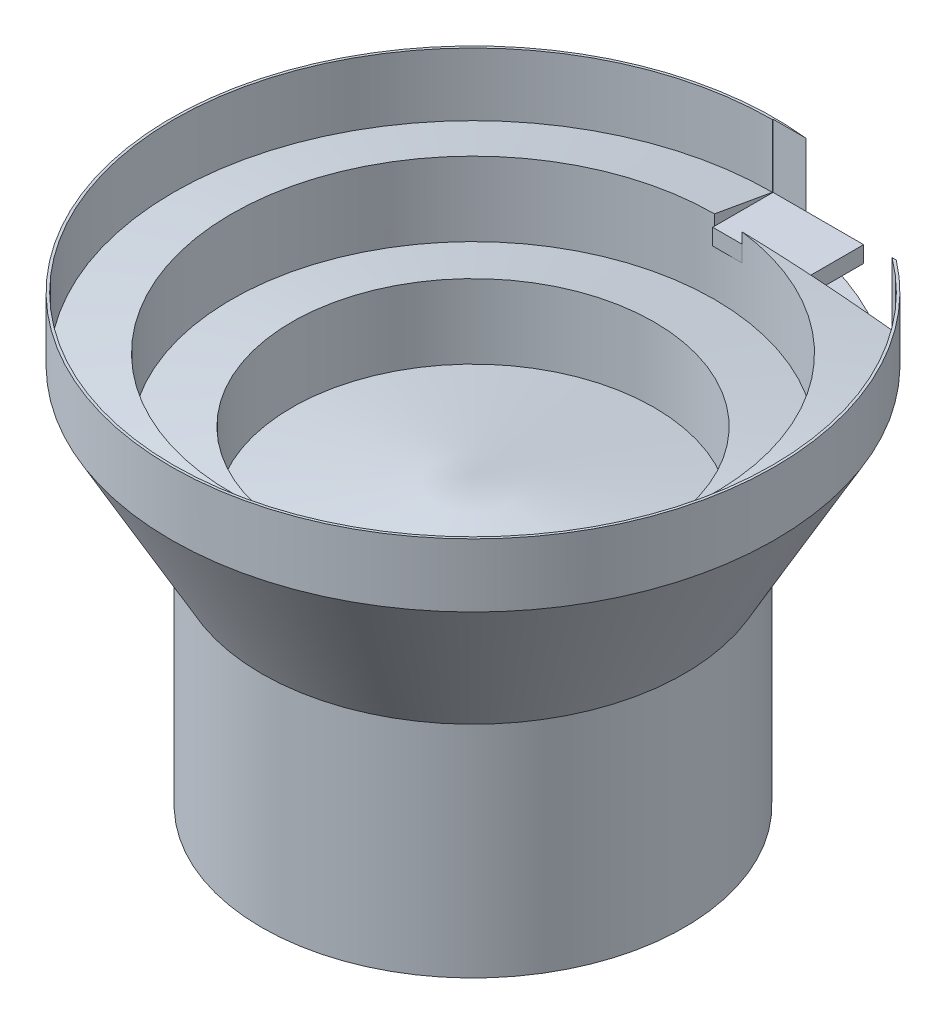
ISO-10303-21;
HEADER;
FILE_DESCRIPTION(('STEP AP214'),'2;1');
FILE_NAME('part.step','',(''),(''),'','','');
FILE_SCHEMA(('AUTOMOTIVE_DESIGN { 1 0 10303 214 1 1 1 1 }'));
ENDSEC;
DATA;
#1=APPLICATION_CONTEXT('core data for automotive mechanical design processes');
#2=APPLICATION_PROTOCOL_DEFINITION('international standard','automotive_design',2000,#1);
#3=PRODUCT_CONTEXT('',#1,'mechanical');
#4=PRODUCT('Part','Part','',(#3));
#5=PRODUCT_RELATED_PRODUCT_CATEGORY('part','',(#4));
#6=PRODUCT_DEFINITION_FORMATION('','',#4);
#7=PRODUCT_DEFINITION_CONTEXT('part definition',#1,'design');
#8=PRODUCT_DEFINITION('design','',#6,#7);
#9=PRODUCT_DEFINITION_SHAPE('','',#8);
#10=(LENGTH_UNIT() NAMED_UNIT(*) SI_UNIT(.MILLI.,.METRE.));
#11=(NAMED_UNIT(*) PLANE_ANGLE_UNIT() SI_UNIT($,.RADIAN.));
#12=(NAMED_UNIT(*) SI_UNIT($,.STERADIAN.) SOLID_ANGLE_UNIT());
#13=UNCERTAINTY_MEASURE_WITH_UNIT(LENGTH_MEASURE(1.E-05),#10,'distance_accuracy_value','');
#14=(GEOMETRIC_REPRESENTATION_CONTEXT(3) GLOBAL_UNCERTAINTY_ASSIGNED_CONTEXT((#13)) GLOBAL_UNIT_ASSIGNED_CONTEXT((#10,
#11,#12)) REPRESENTATION_CONTEXT('',''));
#15=CARTESIAN_POINT('',(0.,0.,0.));
#16=DIRECTION('',(0.,0.,1.));
#17=DIRECTION('',(1.,0.,0.));
#18=AXIS2_PLACEMENT_3D('',#15,#16,#17);
#19=CARTESIAN_POINT('',(0.,631.,-397.));
#20=DIRECTION('',(1.,0.,0.));
#21=DIRECTION('',(0.,0.,-1.));
#22=AXIS2_PLACEMENT_3D('',#19,#20,#21);
#23=PLANE('',#22);
#24=DIRECTION('',(0.,0.,1.));
#25=VECTOR('',#24,1.);
#26=CARTESIAN_POINT('',(0.,604.,-397.));
#27=LINE('',#26,#25);
#28=CARTESIAN_POINT('',(0.,604.,-497.));
#29=VERTEX_POINT('',#28);
#30=CARTESIAN_POINT('',(0.,604.,-397.));
#31=VERTEX_POINT('',#30);
#32=EDGE_CURVE('E112',#29,#31,#27,.T.);
#33=ORIENTED_EDGE('',*,*,#32,.T.);
#34=DIRECTION('',(0.,-1.,0.));
#35=VECTOR('',#34,1.);
#36=CARTESIAN_POINT('',(0.,631.,-397.));
#37=LINE('',#36,#35);
#38=CARTESIAN_POINT('',(0.,631.,-397.));
#39=VERTEX_POINT('',#38);
#40=EDGE_CURVE('E12',#39,#31,#37,.T.);
#41=ORIENTED_EDGE('',*,*,#40,.F.);
#42=DIRECTION('',(0.,0.,1.));
#43=VECTOR('',#42,1.);
#44=CARTESIAN_POINT('',(0.,631.,-397.));
#45=LINE('',#44,#43);
#46=CARTESIAN_POINT('',(0.,631.,-497.));
#47=VERTEX_POINT('',#46);
#48=EDGE_CURVE('E100',#47,#39,#45,.T.);
#49=ORIENTED_EDGE('',*,*,#48,.F.);
#50=DIRECTION('',(0.,-1.,0.));
#51=VECTOR('',#50,1.);
#52=CARTESIAN_POINT('',(0.,631.,-497.));
#53=LINE('',#52,#51);
#54=EDGE_CURVE('E108',#47,#29,#53,.T.);
#55=ORIENTED_EDGE('',*,*,#54,.T.);
#56=EDGE_LOOP('',(#33,#41,#49,#55));
#57=FACE_BOUND('',#56,.T.);
#58=ADVANCED_FACE('F49',(#57),#23,.F.);
#59=CARTESIAN_POINT('',(150.,631.,-397.));
#60=DIRECTION('',(0.,0.,-1.));
#61=DIRECTION('',(-1.,0.,0.));
#62=AXIS2_PLACEMENT_3D('',#59,#60,#61);
#63=PLANE('',#62);
#64=DIRECTION('',(1.,0.,0.));
#65=VECTOR('',#64,1.);
#66=CARTESIAN_POINT('',(150.,604.,-397.));
#67=LINE('',#66,#65);
#68=CARTESIAN_POINT('',(150.,604.,-397.));
#69=VERTEX_POINT('',#68);
#70=EDGE_CURVE('E104',#31,#69,#67,.T.);
#71=ORIENTED_EDGE('',*,*,#70,.T.);
#72=DIRECTION('',(0.,-1.,0.));
#73=VECTOR('',#72,1.);
#74=CARTESIAN_POINT('',(150.,631.,-397.));
#75=LINE('',#74,#73);
#76=CARTESIAN_POINT('',(150.,631.,-397.));
#77=VERTEX_POINT('',#76);
#78=EDGE_CURVE('E57',#77,#69,#75,.T.);
#79=ORIENTED_EDGE('',*,*,#78,.F.);
#80=DIRECTION('',(1.,0.,0.));
#81=VECTOR('',#80,1.);
#82=CARTESIAN_POINT('',(150.,631.,-397.));
#83=LINE('',#82,#81);
#84=EDGE_CURVE('E95',#39,#77,#83,.T.);
#85=ORIENTED_EDGE('',*,*,#84,.F.);
#86=ORIENTED_EDGE('',*,*,#40,.T.);
#87=EDGE_LOOP('',(#71,#79,#85,#86));
#88=FACE_BOUND('',#87,.T.);
#89=ADVANCED_FACE('F103',(#88),#63,.F.);
#90=CARTESIAN_POINT('',(150.,631.,-497.));
#91=DIRECTION('',(-1.,0.,0.));
#92=DIRECTION('',(0.,0.,1.));
#93=AXIS2_PLACEMENT_3D('',#90,#91,#92);
#94=PLANE('',#93);
#95=DIRECTION('',(0.,0.,-1.));
#96=VECTOR('',#95,1.);
#97=CARTESIAN_POINT('',(150.,604.,-497.));
#98=LINE('',#97,#96);
#99=CARTESIAN_POINT('',(150.,604.,-497.));
#100=VERTEX_POINT('',#99);
#101=EDGE_CURVE('E82',#69,#100,#98,.T.);
#102=ORIENTED_EDGE('',*,*,#101,.T.);
#103=DIRECTION('',(0.,-1.,0.));
#104=VECTOR('',#103,1.);
#105=CARTESIAN_POINT('',(150.,631.,-497.));
#106=LINE('',#105,#104);
#107=CARTESIAN_POINT('',(150.,631.,-497.));
#108=VERTEX_POINT('',#107);
#109=EDGE_CURVE('E105',#108,#100,#106,.T.);
#110=ORIENTED_EDGE('',*,*,#109,.F.);
#111=DIRECTION('',(0.,0.,-1.));
#112=VECTOR('',#111,1.);
#113=CARTESIAN_POINT('',(150.,631.,-497.));
#114=LINE('',#113,#112);
#115=EDGE_CURVE('E98',#77,#108,#114,.T.);
#116=ORIENTED_EDGE('',*,*,#115,.F.);
#117=ORIENTED_EDGE('',*,*,#78,.T.);
#118=EDGE_LOOP('',(#102,#110,#116,#117));
#119=FACE_BOUND('',#118,.T.);
#120=ADVANCED_FACE('F106',(#119),#94,.F.);
#121=CARTESIAN_POINT('',(0.,631.,-497.));
#122=DIRECTION('',(0.,0.,1.));
#123=DIRECTION('',(1.,0.,0.));
#124=AXIS2_PLACEMENT_3D('',#121,#122,#123);
#125=PLANE('',#124);
#126=DIRECTION('',(-1.,0.,0.));
#127=VECTOR('',#126,1.);
#128=CARTESIAN_POINT('',(0.,604.,-497.));
#129=LINE('',#128,#127);
#130=EDGE_CURVE('E88',#100,#29,#129,.T.);
#131=ORIENTED_EDGE('',*,*,#130,.T.);
#132=ORIENTED_EDGE('',*,*,#54,.F.);
#133=DIRECTION('',(-1.,0.,0.));
#134=VECTOR('',#133,1.);
#135=CARTESIAN_POINT('',(0.,631.,-497.));
#136=LINE('',#135,#134);
#137=EDGE_CURVE('E65',#108,#47,#136,.T.);
#138=ORIENTED_EDGE('',*,*,#137,.F.);
#139=ORIENTED_EDGE('',*,*,#109,.T.);
#140=EDGE_LOOP('',(#131,#132,#138,#139));
#141=FACE_BOUND('',#140,.T.);
#142=ADVANCED_FACE('F119',(#141),#125,.F.);
#143=CARTESIAN_POINT('',(0.,631.,0.));
#144=DIRECTION('',(0.,-1.,0.));
#145=DIRECTION('',(0.,0.,-1.));
#146=AXIS2_PLACEMENT_3D('',#143,#144,#145);
#147=PLANE('',#146);
#148=ORIENTED_EDGE('',*,*,#48,.T.);
#149=ORIENTED_EDGE('',*,*,#84,.T.);
#150=ORIENTED_EDGE('',*,*,#115,.T.);
#151=ORIENTED_EDGE('',*,*,#137,.T.);
#152=EDGE_LOOP('',(#148,#149,#150,#151));
#153=FACE_BOUND('',#152,.T.);
#154=ADVANCED_FACE('F96',(#153),#147,.F.);
#155=CARTESIAN_POINT('',(0.,604.,0.));
#156=DIRECTION('',(0.,-1.,0.));
#157=DIRECTION('',(0.,0.,-1.));
#158=AXIS2_PLACEMENT_3D('',#155,#156,#157);
#159=PLANE('',#158);
#160=ORIENTED_EDGE('',*,*,#32,.F.);
#161=ORIENTED_EDGE('',*,*,#130,.F.);
#162=ORIENTED_EDGE('',*,*,#101,.F.);
#163=ORIENTED_EDGE('',*,*,#70,.F.);
#164=EDGE_LOOP('',(#160,#161,#162,#163));
#165=FACE_BOUND('',#164,.T.);
#166=ADVANCED_FACE('F122',(#165),#159,.T.);
#167=CLOSED_SHELL('',(#58,#89,#120,#142,#154,#166));
#168=MANIFOLD_SOLID_BREP('B2',#167);
#169=CARTESIAN_POINT('',(0.,364.,0.));
#170=DIRECTION('',(0.,-1.,0.));
#171=DIRECTION('',(0.,0.,-1.));
#172=AXIS2_PLACEMENT_3D('',#169,#170,#171);
#173=CYLINDRICAL_SURFACE('',#172,350.);
#174=CARTESIAN_POINT('',(0.,364.,0.));
#175=DIRECTION('',(0.,1.,0.));
#176=DIRECTION('',(0.,0.,1.));
#177=AXIS2_PLACEMENT_3D('',#174,#175,#176);
#178=CIRCLE('',#177,350.);
#179=CARTESIAN_POINT('',(0.,364.,350.));
#180=VERTEX_POINT('',#179);
#181=EDGE_CURVE('E365',#180,#180,#178,.T.);
#182=ORIENTED_EDGE('',*,*,#181,.F.);
#183=EDGE_LOOP('',(#182));
#184=FACE_BOUND('',#183,.T.);
#185=CARTESIAN_POINT('',(0.,0.,0.));
#186=DIRECTION('',(0.,1.,0.));
#187=DIRECTION('',(0.,0.,1.));
#188=AXIS2_PLACEMENT_3D('',#185,#186,#187);
#189=CIRCLE('',#188,350.);
#190=CARTESIAN_POINT('',(0.,0.,350.));
#191=VERTEX_POINT('',#190);
#192=EDGE_CURVE('E364',#191,#191,#189,.T.);
#193=ORIENTED_EDGE('',*,*,#192,.T.);
#194=EDGE_LOOP('',(#193));
#195=FACE_BOUND('',#194,.T.);
#196=ADVANCED_FACE('F173',(#184,#195),#173,.T.);
#197=CARTESIAN_POINT('',(0.,0.,0.));
#198=DIRECTION('',(0.,1.,0.));
#199=DIRECTION('',(0.,0.,1.));
#200=AXIS2_PLACEMENT_3D('',#197,#198,#199);
#201=PLANE('',#200);
#202=ORIENTED_EDGE('',*,*,#192,.F.);
#203=EDGE_LOOP('',(#202));
#204=FACE_BOUND('',#203,.T.);
#205=ADVANCED_FACE('F321',(#204),#201,.F.);
#206=CARTESIAN_POINT('',(0.,364.,0.));
#207=DIRECTION('',(0.,1.,0.));
#208=DIRECTION('',(0.,0.,1.));
#209=AXIS2_PLACEMENT_3D('',#206,#207,#208);
#210=CONICAL_SURFACE('',#209,350.,0.511855842431824);
#211=CARTESIAN_POINT('',(-500.728669332432,996.800029384998,-497.));
#212=CARTESIAN_POINT('',(-498.268079922734,993.691461389997,-497.));
#213=CARTESIAN_POINT('',(-495.801964050463,990.587271057743,-497.));
#214=CARTESIAN_POINT('',(-490.858286960342,984.388010470301,-497.));
#215=CARTESIAN_POINT('',(-488.380725725398,981.292940228746,-497.));
#216=CARTESIAN_POINT('',(-480.930237337612,972.021897192898,-497.));
#217=CARTESIAN_POINT('',(-475.93956399796,965.860166029041,-497.));
#218=CARTESIAN_POINT('',(-465.906532955227,953.576755592196,-497.));
#219=CARTESIAN_POINT('',(-460.864164588002,947.455085028081,-497.));
#220=CARTESIAN_POINT('',(-450.725131789324,935.256885165823,-497.));
#221=CARTESIAN_POINT('',(-445.628467539704,929.180355716621,-497.));
#222=CARTESIAN_POINT('',(-435.342369733754,917.035998173195,-497.));
#223=CARTESIAN_POINT('',(-430.152542916856,910.968502988335,-497.));
#224=CARTESIAN_POINT('',(-419.709278638408,898.888463215094,-497.));
#225=CARTESIAN_POINT('',(-414.455841122547,892.875918673639,-497.));
#226=CARTESIAN_POINT('',(-403.880770019227,880.911795680262,-497.));
#227=CARTESIAN_POINT('',(-398.559141119414,874.960213087736,-497.));
#228=CARTESIAN_POINT('',(-387.841878530821,863.124002283881,-497.));
#229=CARTESIAN_POINT('',(-382.446244785099,857.239374124074,-497.));
#230=CARTESIAN_POINT('',(-371.337935256842,845.289440001884,-497.));
#231=CARTESIAN_POINT('',(-365.621694202288,839.227444829566,-497.));
#232=CARTESIAN_POINT('',(-354.09450397889,827.194042184914,-497.));
#233=CARTESIAN_POINT('',(-348.283554507111,821.222635002451,-497.));
#234=CARTESIAN_POINT('',(-336.557517033476,809.380625344229,-497.));
#235=CARTESIAN_POINT('',(-330.64240948364,803.510042208046,-497.));
#236=CARTESIAN_POINT('',(-318.699882523145,791.884049384511,-497.));
#237=CARTESIAN_POINT('',(-312.672463894887,786.128638895403,-497.));
#238=CARTESIAN_POINT('',(-303.547912209421,777.601557212849,-497.));
#239=CARTESIAN_POINT('',(-300.496706868887,774.78064248347,-497.));
#240=CARTESIAN_POINT('',(-294.362509253044,769.173606336655,-497.));
#241=CARTESIAN_POINT('',(-291.279517254774,766.387484616444,-497.));
#242=CARTESIAN_POINT('',(-285.080203909848,760.852289074665,-497.));
#243=CARTESIAN_POINT('',(-281.963881130639,758.10321685705,-497.));
#244=CARTESIAN_POINT('',(-275.696608485875,752.64487957306,-497.));
#245=CARTESIAN_POINT('',(-272.545659000949,749.935614069881,-497.));
#246=CARTESIAN_POINT('',(-266.208760246178,744.56069652966,-497.));
#247=CARTESIAN_POINT('',(-263.022824324208,741.89502876378,-497.));
#248=CARTESIAN_POINT('',(-256.613297364347,736.60941986538,-497.));
#249=CARTESIAN_POINT('',(-253.389706861094,733.989478084937,-497.));
#250=CARTESIAN_POINT('',(-246.903478379929,728.798865697311,-497.));
#251=CARTESIAN_POINT('',(-243.640843363862,726.228191390793,-497.));
#252=CARTESIAN_POINT('',(-237.074720610343,721.139649473001,-497.));
#253=CARTESIAN_POINT('',(-233.771233784146,718.621780687193,-497.));
#254=CARTESIAN_POINT('',(-228.238726172243,714.479225331303,-497.));
#255=CARTESIAN_POINT('',(-226.02158855205,712.838654288639,-497.));
#256=CARTESIAN_POINT('',(-221.568111177271,709.583865043188,-497.));
#257=CARTESIAN_POINT('',(-219.331771691325,707.969646472636,-497.));
#258=CARTESIAN_POINT('',(-212.593222651469,703.168502616495,-497.));
#259=CARTESIAN_POINT('',(-208.06136003814,700.02299729356,-497.));
#260=CARTESIAN_POINT('',(-198.913828994845,693.853454399412,-497.));
#261=CARTESIAN_POINT('',(-194.298137975835,690.829450295747,-497.));
#262=CARTESIAN_POINT('',(-184.980624817496,684.916874557164,-497.));
#263=CARTESIAN_POINT('',(-180.278802471596,682.028303247116,-497.));
#264=CARTESIAN_POINT('',(-170.812886193359,676.41707854831,-497.));
#265=CARTESIAN_POINT('',(-166.049294299232,673.693579806888,-497.));
#266=CARTESIAN_POINT('',(-156.431695245317,668.410668867405,-497.));
#267=CARTESIAN_POINT('',(-151.577687024097,665.851258597211,-497.));
#268=CARTESIAN_POINT('',(-141.779298631305,660.914430251942,-497.));
#269=CARTESIAN_POINT('',(-136.834941095261,658.536967346817,-497.));
#270=CARTESIAN_POINT('',(-126.854524385529,653.981777822813,-497.));
#271=CARTESIAN_POINT('',(-121.818462421789,651.804057293187,-497.));
#272=CARTESIAN_POINT('',(-112.743494709477,648.11038127417,-497.));
#273=CARTESIAN_POINT('',(-108.721633756072,646.552493415631,-497.));
#274=CARTESIAN_POINT('',(-100.624905448842,643.582312610454,-497.));
#275=CARTESIAN_POINT('',(-96.5500445837144,642.170002026493,-497.));
#276=CARTESIAN_POINT('',(-88.3497331287131,639.500604732421,-497.));
#277=CARTESIAN_POINT('',(-84.2242829442575,638.243516779263,-497.));
#278=CARTESIAN_POINT('',(-75.9265930569202,635.894130247659,-497.));
#279=CARTESIAN_POINT('',(-71.7543531425398,634.801832414418,-497.));
#280=CARTESIAN_POINT('',(-63.3725089773951,632.792166737828,-497.));
#281=CARTESIAN_POINT('',(-59.162948782968,631.874615584688,-497.));
#282=CARTESIAN_POINT('',(-50.7082203473758,630.221211523255,-497.));
#283=CARTESIAN_POINT('',(-46.4630522378534,629.48535794353,-497.));
#284=CARTESIAN_POINT('',(-37.9442231371215,628.202341920194,-497.));
#285=CARTESIAN_POINT('',(-33.6705621590611,627.655179389509,-497.));
#286=CARTESIAN_POINT('',(-25.1027843692398,626.755011949095,-497.));
#287=CARTESIAN_POINT('',(-20.8086675452824,626.402007155143,-497.));
#288=CARTESIAN_POINT('',(-12.1853341070941,625.892429955656,-497.));
#289=CARTESIAN_POINT('',(-7.85605357021458,625.736935584674,-497.));
#290=CARTESIAN_POINT('',(0.805059306392739,625.627578647008,-497.));
#291=CARTESIAN_POINT('',(5.13689164645237,625.67371610655,-497.));
#292=CARTESIAN_POINT('',(13.7936446393426,625.967125056461,-497.));
#293=CARTESIAN_POINT('',(18.1185654115735,626.214393033741,-497.));
#294=CARTESIAN_POINT('',(26.7524415499728,626.907438456336,-497.));
#295=CARTESIAN_POINT('',(31.0613968622007,627.353216571716,-497.));
#296=CARTESIAN_POINT('',(39.6585615181876,628.439167253747,-497.));
#297=CARTESIAN_POINT('',(43.9467490582346,629.079511978599,-497.));
#298=CARTESIAN_POINT('',(52.4907011013947,630.548108867201,-497.));
#299=CARTESIAN_POINT('',(56.746465847567,631.376359620868,-497.));
#300=CARTESIAN_POINT('',(65.2193007372559,633.213123746043,-497.));
#301=CARTESIAN_POINT('',(69.436366794632,634.221655928118,-497.));
#302=CARTESIAN_POINT('',(77.8257759747749,636.410118427428,-497.));
#303=CARTESIAN_POINT('',(81.9981174156398,637.590055166345,-497.));
#304=CARTESIAN_POINT('',(91.6361562278435,640.520013268311,-497.));
#305=CARTESIAN_POINT('',(97.0833982166782,642.330944933549,-497.));
#306=CARTESIAN_POINT('',(107.884155432383,646.2135816401,-497.));
#307=CARTESIAN_POINT('',(113.237662539834,648.285309145787,-497.));
#308=CARTESIAN_POINT('',(123.848068601568,652.667108634481,-497.));
#309=CARTESIAN_POINT('',(129.104934334443,654.977260837797,-497.));
#310=CARTESIAN_POINT('',(139.518225923458,659.812946473476,-497.));
#311=CARTESIAN_POINT('',(144.674653548569,662.338476108272,-497.));
#312=CARTESIAN_POINT('',(154.902459736176,667.591691341612,-497.));
#313=CARTESIAN_POINT('',(159.973542628213,670.319951162758,-497.));
#314=CARTESIAN_POINT('',(170.016724034169,675.952472301477,-497.));
#315=CARTESIAN_POINT('',(174.988822773589,678.85673321803,-497.));
#316=CARTESIAN_POINT('',(184.835834341049,684.822835466312,-497.));
#317=CARTESIAN_POINT('',(189.710770138112,687.884638927497,-497.));
#318=CARTESIAN_POINT('',(196.953727697585,692.583934959905,-497.));
#319=CARTESIAN_POINT('',(199.356516871726,694.168162774672,-497.));
#320=CARTESIAN_POINT('',(204.139552617472,697.370405945672,-497.));
#321=CARTESIAN_POINT('',(206.519798783947,698.988421907453,-497.));
#322=CARTESIAN_POINT('',(212.265349525176,702.951080117683,-497.));
#323=CARTESIAN_POINT('',(215.61927973296,705.312226776117,-497.));
#324=CARTESIAN_POINT('',(222.283900116033,710.094894238602,-497.));
#325=CARTESIAN_POINT('',(225.594589098297,712.516416703084,-497.));
#326=CARTESIAN_POINT('',(232.174573166155,717.415753316091,-497.));
#327=CARTESIAN_POINT('',(235.443863806153,719.893573431682,-497.));
#328=CARTESIAN_POINT('',(241.942244732283,724.901293768693,-497.));
#329=CARTESIAN_POINT('',(245.171335319025,727.431193600294,-497.));
#330=CARTESIAN_POINT('',(251.592429849963,732.54068670866,-497.));
#331=CARTESIAN_POINT('',(254.784415531276,735.120302922597,-497.));
#332=CARTESIAN_POINT('',(261.131334932585,740.32478463301,-497.));
#333=CARTESIAN_POINT('',(264.286268136971,742.949650757916,-497.));
#334=CARTESIAN_POINT('',(270.560377754705,748.241412245839,-497.));
#335=CARTESIAN_POINT('',(273.679556089445,750.908305331951,-497.));
#336=CARTESIAN_POINT('',(279.88382671746,756.281497643862,-497.));
#337=CARTESIAN_POINT('',(282.968918636514,758.987797301536,-497.));
#338=CARTESIAN_POINT('',(289.11270664831,764.442811870996,-497.));
#339=CARTESIAN_POINT('',(292.17133549812,767.191602494203,-497.));
#340=CARTESIAN_POINT('',(298.257137830963,772.723804528606,-497.));
#341=CARTESIAN_POINT('',(301.284311038993,775.507216242015,-497.));
#342=CARTESIAN_POINT('',(310.320614466555,783.906048035647,-497.));
#343=CARTESIAN_POINT('',(316.284603913496,789.570131906064,-497.));
#344=CARTESIAN_POINT('',(328.100501543021,801.011109410259,-497.));
#345=CARTESIAN_POINT('',(333.952434720048,806.787977292749,-497.));
#346=CARTESIAN_POINT('',(345.554635658646,818.442795789755,-497.));
#347=CARTESIAN_POINT('',(351.304903735797,824.320746090386,-497.));
#348=CARTESIAN_POINT('',(362.744611366734,836.200528589168,-497.));
#349=CARTESIAN_POINT('',(368.433513605476,842.20287762689,-497.));
#350=CARTESIAN_POINT('',(379.724250306271,854.288848298017,-497.));
#351=CARTESIAN_POINT('',(385.326084716159,860.372469980111,-497.));
#352=CARTESIAN_POINT('',(396.449666991296,872.61283169663,-497.));
#353=CARTESIAN_POINT('',(401.971411996237,878.769574328279,-497.));
#354=CARTESIAN_POINT('',(412.940744303813,891.148717211717,-497.));
#355=CARTESIAN_POINT('',(418.388331657553,897.371117418255,-497.));
#356=CARTESIAN_POINT('',(429.208852166798,909.868292718846,-497.));
#357=CARTESIAN_POINT('',(434.581861950883,916.143001507561,-497.));
#358=CARTESIAN_POINT('',(445.264442034761,928.746168396537,-497.));
#359=CARTESIAN_POINT('',(450.574012289178,935.074626535236,-497.));
#360=CARTESIAN_POINT('',(461.134099985589,947.780295279107,-497.));
#361=CARTESIAN_POINT('',(466.384619089578,954.157504503651,-497.));
#362=CARTESIAN_POINT('',(476.830863049058,966.956592192453,-497.));
#363=CARTESIAN_POINT('',(482.026588071394,973.378470520598,-497.));
#364=CARTESIAN_POINT('',(492.202174952868,986.057776447884,-497.));
#365=CARTESIAN_POINT('',(497.18363784672,992.313919771784,-497.));
#366=CARTESIAN_POINT('',(507.101788687026,1004.86148972684,-497.));
#367=CARTESIAN_POINT('',(512.038477060338,1011.15291602069,-497.));
#368=CARTESIAN_POINT('',(521.870728201075,1023.769379895,-497.));
#369=CARTESIAN_POINT('',(526.766284473224,1030.09442253569,-497.));
#370=CARTESIAN_POINT('',(536.518111402218,1042.77473551017,-497.));
#371=CARTESIAN_POINT('',(541.374381967203,1049.13000591458,-497.));
#372=CARTESIAN_POINT('',(550.999679581584,1061.80229930089,-497.));
#373=CARTESIAN_POINT('',(555.769088641552,1068.11903220816,-497.));
#374=CARTESIAN_POINT('',(565.27389476793,1080.77803134203,-497.));
#375=CARTESIAN_POINT('',(570.009291829367,1087.12029757235,-497.));
#376=CARTESIAN_POINT('',(579.447156060363,1099.82742102389,-497.));
#377=CARTESIAN_POINT('',(584.149629272838,1106.19227375823,-497.));
#378=CARTESIAN_POINT('',(593.524316604131,1118.94419244079,-497.));
#379=CARTESIAN_POINT('',(598.196530828684,1125.33125831128,-497.));
#380=CARTESIAN_POINT('',(602.854516250732,1131.72866933243,-497.));
#381=B_SPLINE_CURVE_WITH_KNOTS('',3,(#211,#212,#213,#214,#215,#216,#217,#218,#219,#220,#221,
#222,#223,#224,#225,#226,#227,#228,#229,#230,#231,#232,#233,#234,#235,#236,#237,#238,#239,#240,
#241,#242,#243,#244,#245,#246,#247,#248,#249,#250,#251,#252,#253,#254,#255,#256,#257,#258,#259,
#260,#261,#262,#263,#264,#265,#266,#267,#268,#269,#270,#271,#272,#273,#274,#275,#276,#277,#278,
#279,#280,#281,#282,#283,#284,#285,#286,#287,#288,#289,#290,#291,#292,#293,#294,#295,#296,#297,
#298,#299,#300,#301,#302,#303,#304,#305,#306,#307,#308,#309,#310,#311,#312,#313,#314,#315,#316,
#317,#318,#319,#320,#321,#322,#323,#324,#325,#326,#327,#328,#329,#330,#331,#332,#333,#334,#335,
#336,#337,#338,#339,#340,#341,#342,#343,#344,#345,#346,#347,#348,#349,#350,#351,#352,#353,#354,
#355,#356,#357,#358,#359,#360,#361,#362,#363,#364,#365,#366,#367,#368,#369,#370,#371,#372,#373,
#374,#375,#376,#377,#378,#379,#380),.UNSPECIFIED.,.F.,.F.,(4,2,2,2,2,2,2,2,2,2,2,2,2,2,2,2,2,2,
2,2,2,2,2,2,2,2,2,2,2,2,2,2,2,2,2,2,2,2,2,2,2,2,2,2,2,2,2,2,2,2,2,2,2,2,2,2,2,2,2,2,2,2,2,2,2,2,
2,2,2,2,2,2,2,2,2,2,2,2,2,2,2,2,2,2,4),(0.,11.8936521784545,23.7873221260337,47.5749448610504,
71.3675776368043,95.1601307581196,119.112577710893,143.065045115833,167.015874708269,
190.966722729952,215.961964554134,240.957286343666,265.957350239338,290.957240040594,
303.423244542455,315.889140487178,328.355574384846,340.821871384117,353.283567011467,
365.745085916427,378.205665431198,390.665967495233,398.940116050525,407.214149035537,
423.761755772749,440.313889734574,456.86606339892,473.324701530836,489.783532999023,
506.238296028074,522.693560522827,535.630174564694,548.565219432492,561.500160707743,
574.435160475062,587.356515735461,600.27782324654,613.199124794903,626.120434048279,
639.111970426075,652.103508493672,665.094819646765,678.086174652009,691.089058427594,
704.091844630232,717.095988336485,730.100619369421,747.314200069933,764.529264525836,
781.750140157986,798.970712211759,816.242070324731,833.513389086335,850.780575338733,
859.414491823429,868.048563177699,880.352881730211,892.657539044778,904.963506687327,
917.269382252323,929.581078023995,941.892944918173,954.204147066691,966.515484240921,
978.852112103568,991.188847729518,1015.86201612019,1040.52961543603,1065.1971381672,
1090.00599989137,1114.81487647874,1139.62463691801,1164.4343802594,1189.21639653107,
1213.99843052723,1238.77976527813,1263.56102454919,1287.55223819677,1311.54322288284,
1335.53792741026,1359.53268802726,1383.27778522749,1407.02288589938,1430.76350765425,
1454.50404640796),.UNSPECIFIED.);
#382=CARTESIAN_POINT('',(0.,625.66,-497.));
#383=VERTEX_POINT('',#382);
#384=CARTESIAN_POINT('',(54.6900356555013,631.,-497.));
#385=VERTEX_POINT('',#384);
#386=EDGE_CURVE('E326',#383,#385,#381,.T.);
#387=ORIENTED_EDGE('',*,*,#386,.F.);
#388=DIRECTION('',(0.,-0.87183702518523,0.489796081564735));
#389=VECTOR('',#388,1.);
#390=CARTESIAN_POINT('',(0.,-259.,0.));
#391=LINE('',#390,#389);
#392=CARTESIAN_POINT('',(0.,604.,-484.831460674157));
#393=VERTEX_POINT('',#392);
#394=EDGE_CURVE('E243',#393,#383,#391,.F.);
#395=ORIENTED_EDGE('',*,*,#394,.F.);
#396=CARTESIAN_POINT('',(0.,604.,0.));
#397=DIRECTION('',(0.,1.,0.));
#398=DIRECTION('',(0.,0.,1.));
#399=AXIS2_PLACEMENT_3D('',#396,#397,#398);
#400=CIRCLE('',#399,484.831460674157);
#401=CARTESIAN_POINT('',(278.30297386021,604.,-397.));
#402=VERTEX_POINT('',#401);
#403=EDGE_CURVE('E247',#393,#402,#400,.F.);
#404=ORIENTED_EDGE('',*,*,#403,.T.);
#405=CARTESIAN_POINT('',(303.959525691467,631.0007,-397.));
#406=CARTESIAN_POINT('',(301.406796020939,628.238436702819,-397.));
#407=CARTESIAN_POINT('',(298.843152869646,625.486237393024,-397.));
#408=CARTESIAN_POINT('',(293.692917543942,620.003336530633,-397.));
#409=CARTESIAN_POINT('',(291.106325093157,617.272635237684,-397.));
#410=CARTESIAN_POINT('',(285.908776046285,611.833795843973,-397.));
#411=CARTESIAN_POINT('',(283.297816173892,609.125660872779,-397.));
#412=CARTESIAN_POINT('',(278.050715261437,603.733904110002,-397.));
#413=CARTESIAN_POINT('',(275.414574295804,601.05028224601,-397.));
#414=CARTESIAN_POINT('',(270.108015301928,595.701329503677,-397.));
#415=CARTESIAN_POINT('',(267.437518842541,593.036076403775,-397.));
#416=CARTESIAN_POINT('',(262.068630846799,587.733818811993,-397.));
#417=CARTESIAN_POINT('',(259.370239385962,585.096814243677,-397.));
#418=CARTESIAN_POINT('',(253.944234146681,579.853178802479,-397.));
#419=CARTESIAN_POINT('',(251.216621172691,577.246547097551,-397.));
#420=CARTESIAN_POINT('',(245.730659042116,572.065874634791,-397.));
#421=CARTESIAN_POINT('',(242.972310210448,569.49183353305,-397.));
#422=CARTESIAN_POINT('',(237.32562678931,564.288801332875,-397.));
#423=CARTESIAN_POINT('',(234.436134590209,561.661065697278,-397.));
#424=CARTESIAN_POINT('',(228.62071513992,556.446194187042,-397.));
#425=CARTESIAN_POINT('',(225.694787844401,553.859058361808,-397.));
#426=CARTESIAN_POINT('',(219.804431271128,548.728599875097,-397.));
#427=CARTESIAN_POINT('',(216.839999664277,546.185279885858,-397.));
#428=CARTESIAN_POINT('',(210.870844066339,541.146348663993,-397.));
#429=CARTESIAN_POINT('',(207.866120165012,538.650737325118,-397.));
#430=CARTESIAN_POINT('',(201.817684929154,533.714087787697,-397.));
#431=CARTESIAN_POINT('',(198.774020506186,531.272992159352,-397.));
#432=CARTESIAN_POINT('',(192.642326104892,526.447068435132,-397.));
#433=CARTESIAN_POINT('',(189.554295755568,524.062240810223,-397.));
#434=CARTESIAN_POINT('',(183.332132395575,519.354214028533,-397.));
#435=CARTESIAN_POINT('',(180.198004866229,517.03100763513,-397.));
#436=CARTESIAN_POINT('',(173.881264035451,512.451617425691,-397.));
#437=CARTESIAN_POINT('',(170.698652199759,510.195431589599,-397.));
#438=CARTESIAN_POINT('',(164.002306666449,505.562166925754,-397.));
#439=CARTESIAN_POINT('',(160.4839473884,503.191760474167,-397.));
#440=CARTESIAN_POINT('',(153.3848216038,498.546350446463,-397.));
#441=CARTESIAN_POINT('',(149.804056465252,496.271344782773,-397.));
#442=CARTESIAN_POINT('',(142.577114511145,491.826141563698,-397.));
#443=CARTESIAN_POINT('',(138.930926879048,489.655961562637,-397.));
#444=CARTESIAN_POINT('',(131.571785552546,485.43167548825,-397.));
#445=CARTESIAN_POINT('',(127.858831797009,483.377569521214,-397.));
#446=CARTESIAN_POINT('',(120.412310071918,479.422561822471,-397.));
#447=CARTESIAN_POINT('',(116.679599860493,477.520048260675,-397.));
#448=CARTESIAN_POINT('',(109.147186987931,473.852149106812,-397.));
#449=CARTESIAN_POINT('',(105.347483558124,472.086765089404,-397.));
#450=CARTESIAN_POINT('',(97.6822782954819,468.706676619223,-397.));
#451=CARTESIAN_POINT('',(93.8167879867593,467.091946090752,-397.));
#452=CARTESIAN_POINT('',(86.0212212028988,464.026715349689,-397.));
#453=CARTESIAN_POINT('',(82.0911484327775,462.576205753349,-397.));
#454=CARTESIAN_POINT('',(75.0188833715297,460.145357641633,-397.));
#455=CARTESIAN_POINT('',(71.8884000889954,459.130886401345,-397.));
#456=CARTESIAN_POINT('',(65.5919463763009,457.218743850043,-397.));
#457=CARTESIAN_POINT('',(62.4259769265474,456.321069320783,-397.));
#458=CARTESIAN_POINT('',(56.0626376314666,454.649307648351,-397.));
#459=CARTESIAN_POINT('',(52.8652785320099,453.875179676008,-397.));
#460=CARTESIAN_POINT('',(46.4420003276931,452.456235151403,-397.));
#461=CARTESIAN_POINT('',(43.2160818892888,451.811415589883,-397.));
#462=CARTESIAN_POINT('',(36.6833863594927,450.64634173288,-397.));
#463=CARTESIAN_POINT('',(33.3761835119445,450.128470899874,-397.));
#464=CARTESIAN_POINT('',(26.742282037208,449.236954251567,-397.));
#465=CARTESIAN_POINT('',(23.4155837669796,448.863305803888,-397.));
#466=CARTESIAN_POINT('',(18.4133950616248,448.413458133973,-397.));
#467=CARTESIAN_POINT('',(16.7427169437532,448.281889309317,-397.));
#468=CARTESIAN_POINT('',(13.3988165733203,448.056101397382,-397.));
#469=CARTESIAN_POINT('',(11.7255943355082,447.961882094394,-397.));
#470=CARTESIAN_POINT('',(8.37729550184418,447.811033118007,-397.));
#471=CARTESIAN_POINT('',(6.70221873789445,447.754407189526,-397.));
#472=CARTESIAN_POINT('',(3.35119662352417,447.678879621199,-397.));
#473=CARTESIAN_POINT('',(1.67525126361771,447.659978402412,-397.));
#474=CARTESIAN_POINT('',(-0.000700000000009196,447.660000001099,-397.));
#475=B_SPLINE_CURVE_WITH_KNOTS('',3,(#405,#406,#407,#408,#409,#410,#411,#412,#413,#414,#415,
#416,#417,#418,#419,#420,#421,#422,#423,#424,#425,#426,#427,#428,#429,#430,#431,#432,#433,#434,
#435,#436,#437,#438,#439,#440,#441,#442,#443,#444,#445,#446,#447,#448,#449,#450,#451,#452,#453,
#454,#455,#456,#457,#458,#459,#460,#461,#462,#463,#464,#465,#466,#467,#468,#469,#470,#471,#472,
#473,#474),.UNSPECIFIED.,.F.,.F.,(4,2,2,2,2,2,2,2,2,2,2,2,2,2,2,2,2,2,2,2,2,2,2,2,2,2,2,2,2,2,2,
2,2,2,4),(0.,11.2835550328906,22.5672461376338,33.8524768919437,45.1376743002399,
56.4563169238358,67.7749289133249,79.0932301037252,90.4114117591073,102.128025931334,
113.844654360722,125.561994851616,137.279309244122,148.983634513108,160.6880577132,
172.391100238332,184.093789665429,196.819463643558,209.544859011339,222.272378064173,
234.999908771416,247.566121791866,260.132479089045,272.696657300938,285.260117220391,
295.130314207076,305.000239170307,314.866895575766,324.733322338357,334.772820165311,
344.812134740488,349.839343066275,354.8665223573,359.894202362852,364.921938484006),.UNSPECIFIED.);
#476=CARTESIAN_POINT('',(303.958878797774,631.,-397.));
#477=VERTEX_POINT('',#476);
#478=EDGE_CURVE('E305',#477,#402,#475,.T.);
#479=ORIENTED_EDGE('',*,*,#478,.F.);
#480=CARTESIAN_POINT('',(0.,631.,0.));
#481=DIRECTION('',(0.,-1.,0.));
#482=DIRECTION('',(0.,0.,-1.));
#483=AXIS2_PLACEMENT_3D('',#480,#481,#482);
#484=CIRCLE('',#483,500.);
#485=EDGE_CURVE('E360',#477,#385,#484,.T.);
#486=ORIENTED_EDGE('',*,*,#485,.T.);
#487=EDGE_LOOP('',(#387,#395,#404,#479,#486));
#488=FACE_BOUND('',#487,.T.);
#489=ORIENTED_EDGE('',*,*,#181,.T.);
#490=EDGE_LOOP('',(#489));
#491=FACE_BOUND('',#490,.T.);
#492=ADVANCED_FACE('F316',(#488,#491),#210,.T.);
#493=CARTESIAN_POINT('',(0.,364.,0.));
#494=DIRECTION('',(0.,-1.,0.));
#495=DIRECTION('',(0.,0.,-1.));
#496=AXIS2_PLACEMENT_3D('',#493,#494,#495);
#497=CYLINDRICAL_SURFACE('',#496,500.);
#498=DIRECTION('',(0.,-1.,0.));
#499=VECTOR('',#498,1.);
#500=CARTESIAN_POINT('',(303.958878797774,364.,-397.));
#501=LINE('',#500,#499);
#502=CARTESIAN_POINT('',(303.958878797774,736.,-397.));
#503=VERTEX_POINT('',#502);
#504=EDGE_CURVE('E314',#503,#477,#501,.T.);
#505=ORIENTED_EDGE('',*,*,#504,.F.);
#506=CARTESIAN_POINT('',(0.,736.,0.));
#507=DIRECTION('',(0.,-1.,0.));
#508=DIRECTION('',(0.,0.,-1.));
#509=AXIS2_PLACEMENT_3D('',#506,#507,#508);
#510=CIRCLE('',#509,500.);
#511=CARTESIAN_POINT('',(54.6900356555013,736.,-497.));
#512=VERTEX_POINT('',#511);
#513=EDGE_CURVE('E357',#503,#512,#510,.T.);
#514=ORIENTED_EDGE('',*,*,#513,.T.);
#515=DIRECTION('',(0.,-1.,0.));
#516=VECTOR('',#515,1.);
#517=CARTESIAN_POINT('',(54.6900356555013,364.,-497.));
#518=LINE('',#517,#516);
#519=EDGE_CURVE('E254',#385,#512,#518,.F.);
#520=ORIENTED_EDGE('',*,*,#519,.F.);
#521=ORIENTED_EDGE('',*,*,#485,.F.);
#522=EDGE_LOOP('',(#505,#514,#520,#521));
#523=FACE_BOUND('',#522,.T.);
#524=ADVANCED_FACE('F320',(#523),#497,.T.);
#525=CARTESIAN_POINT('',(0.,736.,-500.));
#526=DIRECTION('',(0.,1.,0.));
#527=DIRECTION('',(0.,0.,1.));
#528=AXIS2_PLACEMENT_3D('',#525,#526,#527);
#529=PLANE('',#528);
#530=DIRECTION('',(-1.,0.,0.));
#531=VECTOR('',#530,1.);
#532=CARTESIAN_POINT('',(0.,736.,-397.));
#533=LINE('',#532,#531);
#534=CARTESIAN_POINT('',(297.076936676173,736.,-397.));
#535=VERTEX_POINT('',#534);
#536=EDGE_CURVE('E248',#503,#535,#533,.T.);
#537=ORIENTED_EDGE('',*,*,#536,.T.);
#538=CARTESIAN_POINT('',(0.,736.,0.));
#539=DIRECTION('',(0.,-1.,0.));
#540=DIRECTION('',(0.,0.,-1.));
#541=AXIS2_PLACEMENT_3D('',#538,#539,#540);
#542=CIRCLE('',#541,495.846454363545);
#543=CARTESIAN_POINT('',(0.,736.,-495.846454363545));
#544=VERTEX_POINT('',#543);
#545=EDGE_CURVE('E264',#535,#544,#542,.T.);
#546=ORIENTED_EDGE('',*,*,#545,.T.);
#547=DIRECTION('',(0.,0.,-1.));
#548=VECTOR('',#547,1.);
#549=CARTESIAN_POINT('',(0.,736.,-497.));
#550=LINE('',#549,#548);
#551=CARTESIAN_POINT('',(0.,736.,-497.));
#552=VERTEX_POINT('',#551);
#553=EDGE_CURVE('E240',#544,#552,#550,.T.);
#554=ORIENTED_EDGE('',*,*,#553,.T.);
#555=DIRECTION('',(1.,0.,0.));
#556=VECTOR('',#555,1.);
#557=CARTESIAN_POINT('',(0.,736.,-497.));
#558=LINE('',#557,#556);
#559=EDGE_CURVE('E251',#552,#512,#558,.T.);
#560=ORIENTED_EDGE('',*,*,#559,.T.);
#561=ORIENTED_EDGE('',*,*,#513,.F.);
#562=EDGE_LOOP('',(#537,#546,#554,#560,#561));
#563=FACE_BOUND('',#562,.T.);
#564=ADVANCED_FACE('F262',(#563),#529,.T.);
#565=CARTESIAN_POINT('',(0.,364.,0.));
#566=DIRECTION('',(0.,-1.,0.));
#567=DIRECTION('',(0.,0.,-1.));
#568=AXIS2_PLACEMENT_3D('',#565,#566,#567);
#569=CYLINDRICAL_SURFACE('',#568,495.846454363545);
#570=DIRECTION('',(0.,-1.,0.));
#571=VECTOR('',#570,1.);
#572=CARTESIAN_POINT('',(0.,364.,-495.846454363545));
#573=LINE('',#572,#571);
#574=CARTESIAN_POINT('',(0.,631.732382161311,-495.846454363544));
#575=VERTEX_POINT('',#574);
#576=EDGE_CURVE('E388',#544,#575,#573,.T.);
#577=ORIENTED_EDGE('',*,*,#576,.F.);
#578=ORIENTED_EDGE('',*,*,#545,.F.);
#579=DIRECTION('',(0.,-1.,0.));
#580=VECTOR('',#579,1.);
#581=CARTESIAN_POINT('',(297.076936676173,364.,-397.));
#582=LINE('',#581,#580);
#583=CARTESIAN_POINT('',(297.076936676173,631.732382161311,-397.));
#584=VERTEX_POINT('',#583);
#585=EDGE_CURVE('E288',#584,#535,#582,.F.);
#586=ORIENTED_EDGE('',*,*,#585,.F.);
#587=CARTESIAN_POINT('',(0.,631.732382161311,0.));
#588=DIRECTION('',(0.,-1.,0.));
#589=DIRECTION('',(0.,0.,-1.));
#590=AXIS2_PLACEMENT_3D('',#587,#588,#589);
#591=CIRCLE('',#590,495.846454363545);
#592=EDGE_CURVE('E351',#584,#575,#591,.T.);
#593=ORIENTED_EDGE('',*,*,#592,.T.);
#594=EDGE_LOOP('',(#577,#578,#586,#593));
#595=FACE_BOUND('',#594,.T.);
#596=ADVANCED_FACE('F397',(#595),#569,.F.);
#597=CARTESIAN_POINT('',(0.,631.732382161311,0.));
#598=DIRECTION('',(0.,-1.,0.));
#599=DIRECTION('',(0.,0.,-1.));
#600=AXIS2_PLACEMENT_3D('',#597,#598,#599);
#601=CONICAL_SURFACE('',#600,495.846454363545,1.39626340159547);
#602=DIRECTION('',(0.,-0.173648177666928,-0.984807753012209));
#603=VECTOR('',#602,1.);
#604=CARTESIAN_POINT('',(0.,719.163490354231,0.));
#605=LINE('',#604,#603);
#606=CARTESIAN_POINT('',(0.,648.632698070847,-400.));
#607=VERTEX_POINT('',#606);
#608=EDGE_CURVE('E313',#575,#607,#605,.F.);
#609=ORIENTED_EDGE('',*,*,#608,.F.);
#610=ORIENTED_EDGE('',*,*,#592,.F.);
#611=CARTESIAN_POINT('',(-0.0007,649.161679012863,-397.));
#612=CARTESIAN_POINT('',(3.10229218129817,649.161682855787,-397.));
#613=CARTESIAN_POINT('',(6.20528072082556,649.155265791524,-397.));
#614=CARTESIAN_POINT('',(12.4112037451827,649.129614991696,-397.));
#615=CARTESIAN_POINT('',(15.5141382300311,649.110381260664,-397.));
#616=CARTESIAN_POINT('',(24.8227639439858,649.033493021267,-397.));
#617=CARTESIAN_POINT('',(31.0283072273321,648.956651466159,-397.));
#618=CARTESIAN_POINT('',(43.4383244617998,648.75232266823,-397.));
#619=CARTESIAN_POINT('',(49.6427984436127,648.624837268199,-397.));
#620=CARTESIAN_POINT('',(62.0505263372274,648.320074086017,-397.));
#621=CARTESIAN_POINT('',(68.2537802483253,648.142796275227,-397.));
#622=CARTESIAN_POINT('',(80.6543309818789,647.739742340417,-397.));
#623=CARTESIAN_POINT('',(86.8516289210861,647.514000492736,-397.));
#624=CARTESIAN_POINT('',(99.2443283874476,647.01535929048,-397.));
#625=CARTESIAN_POINT('',(105.439729912973,646.742459895526,-397.));
#626=CARTESIAN_POINT('',(117.828387186727,646.151137497843,-397.));
#627=CARTESIAN_POINT('',(124.021642924707,645.832714280637,-397.));
#628=CARTESIAN_POINT('',(136.405740528733,645.152164051878,-397.));
#629=CARTESIAN_POINT('',(142.596582394726,644.790037039362,-397.));
#630=CARTESIAN_POINT('',(161.162160012536,643.641186987586,-397.));
#631=CARTESIAN_POINT('',(173.533058596808,642.791844544726,-397.));
#632=CARTESIAN_POINT('',(198.263621597999,640.942647093974,-397.));
#633=CARTESIAN_POINT('',(210.623285912008,639.942790721032,-397.));
#634=CARTESIAN_POINT('',(229.158501598429,638.342315161571,-397.));
#635=CARTESIAN_POINT('',(235.338431681733,637.79182375502,-397.));
#636=CARTESIAN_POINT('',(247.695421149114,636.659389804758,-397.));
#637=CARTESIAN_POINT('',(253.872480530067,636.077447226902,-397.));
#638=CARTESIAN_POINT('',(266.223512674151,634.884124354042,-397.));
#639=CARTESIAN_POINT('',(272.397485545387,634.272745175494,-397.));
#640=CARTESIAN_POINT('',(284.742614778322,633.022418544824,-397.));
#641=CARTESIAN_POINT('',(290.913771151557,632.383471206673,-397.));
#642=CARTESIAN_POINT('',(297.083562722062,631.731682161311,-397.));
#643=B_SPLINE_CURVE_WITH_KNOTS('',3,(#611,#612,#613,#614,#615,#616,#617,#618,#619,#620,#621,
#622,#623,#624,#625,#626,#627,#628,#629,#630,#631,#632,#633,#634,#635,#636,#637,#638,#639,#640,
#641,#642),.UNSPECIFIED.,.F.,.F.,(4,2,2,2,2,2,2,2,2,2,2,2,2,2,2,4),(0.,9.30896266154002,
18.617922032055,37.2357513913572,55.8529033618157,74.4700660406153,93.074104797408,
111.678159483423,130.282301821034,148.88644456834,186.085387531426,223.284667881739,
241.897800670471,260.510953666122,279.12340126663,297.735771927915),.UNSPECIFIED.);
#644=CARTESIAN_POINT('',(48.8978527135907,648.632698070847,-397.));
#645=VERTEX_POINT('',#644);
#646=EDGE_CURVE('E279',#645,#584,#643,.T.);
#647=ORIENTED_EDGE('',*,*,#646,.F.);
#648=CARTESIAN_POINT('',(0.,648.632698070846,0.));
#649=DIRECTION('',(0.,-1.,0.));
#650=DIRECTION('',(0.,0.,-1.));
#651=AXIS2_PLACEMENT_3D('',#648,#649,#650);
#652=CIRCLE('',#651,400.);
#653=EDGE_CURVE('E347',#645,#607,#652,.T.);
#654=ORIENTED_EDGE('',*,*,#653,.T.);
#655=EDGE_LOOP('',(#609,#610,#647,#654));
#656=FACE_BOUND('',#655,.T.);
#657=ADVANCED_FACE('F290',(#656),#601,.T.);
#658=CARTESIAN_POINT('',(0.,364.,0.));
#659=DIRECTION('',(0.,-1.,0.));
#660=DIRECTION('',(0.,0.,-1.));
#661=AXIS2_PLACEMENT_3D('',#658,#659,#660);
#662=CYLINDRICAL_SURFACE('',#661,400.);
#663=DIRECTION('',(0.,-1.,0.));
#664=VECTOR('',#663,1.);
#665=CARTESIAN_POINT('',(0.,364.,-400.));
#666=LINE('',#665,#664);
#667=CARTESIAN_POINT('',(0.,604.,-400.));
#668=VERTEX_POINT('',#667);
#669=EDGE_CURVE('E47',#607,#668,#666,.T.);
#670=ORIENTED_EDGE('',*,*,#669,.F.);
#671=ORIENTED_EDGE('',*,*,#653,.F.);
#672=DIRECTION('',(0.,-1.,0.));
#673=VECTOR('',#672,1.);
#674=CARTESIAN_POINT('',(48.8978527135907,364.,-397.));
#675=LINE('',#674,#673);
#676=CARTESIAN_POINT('',(48.8978527135907,604.,-397.));
#677=VERTEX_POINT('',#676);
#678=EDGE_CURVE('E181',#677,#645,#675,.F.);
#679=ORIENTED_EDGE('',*,*,#678,.F.);
#680=CARTESIAN_POINT('',(0.,604.,0.));
#681=DIRECTION('',(0.,1.,0.));
#682=DIRECTION('',(0.,0.,1.));
#683=AXIS2_PLACEMENT_3D('',#680,#681,#682);
#684=CIRCLE('',#683,400.);
#685=EDGE_CURVE('E369',#677,#668,#684,.T.);
#686=ORIENTED_EDGE('',*,*,#685,.T.);
#687=EDGE_LOOP('',(#670,#671,#679,#686));
#688=FACE_BOUND('',#687,.T.);
#689=CARTESIAN_POINT('',(0.,526.,0.));
#690=DIRECTION('',(0.,-1.,0.));
#691=DIRECTION('',(0.,0.,-1.));
#692=AXIS2_PLACEMENT_3D('',#689,#690,#691);
#693=CIRCLE('',#692,400.);
#694=CARTESIAN_POINT('',(0.,526.,-400.));
#695=VERTEX_POINT('',#694);
#696=EDGE_CURVE('E343',#695,#695,#693,.T.);
#697=ORIENTED_EDGE('',*,*,#696,.T.);
#698=EDGE_LOOP('',(#697));
#699=FACE_BOUND('',#698,.T.);
#700=ADVANCED_FACE('F386',(#688,#699),#662,.F.);
#701=CARTESIAN_POINT('',(0.,526.,0.));
#702=DIRECTION('',(0.,-1.,0.));
#703=DIRECTION('',(0.,0.,-1.));
#704=AXIS2_PLACEMENT_3D('',#701,#702,#703);
#705=CONICAL_SURFACE('',#704,400.,1.39626340159546);
#706=CARTESIAN_POINT('',(0.,543.632698070847,0.));
#707=DIRECTION('',(0.,-1.,0.));
#708=DIRECTION('',(0.,0.,-1.));
#709=AXIS2_PLACEMENT_3D('',#706,#707,#708);
#710=CIRCLE('',#709,300.);
#711=CARTESIAN_POINT('',(0.,543.632698070847,-300.));
#712=VERTEX_POINT('',#711);
#713=EDGE_CURVE('E339',#712,#712,#710,.T.);
#714=ORIENTED_EDGE('',*,*,#713,.T.);
#715=EDGE_LOOP('',(#714));
#716=FACE_BOUND('',#715,.T.);
#717=ORIENTED_EDGE('',*,*,#696,.F.);
#718=EDGE_LOOP('',(#717));
#719=FACE_BOUND('',#718,.T.);
#720=ADVANCED_FACE('F450',(#716,#719),#705,.T.);
#721=CARTESIAN_POINT('',(0.,364.,0.));
#722=DIRECTION('',(0.,-1.,0.));
#723=DIRECTION('',(0.,0.,-1.));
#724=AXIS2_PLACEMENT_3D('',#721,#722,#723);
#725=CYLINDRICAL_SURFACE('',#724,300.);
#726=CARTESIAN_POINT('',(0.,421.,0.));
#727=DIRECTION('',(0.,-1.,0.));
#728=DIRECTION('',(0.,0.,-1.));
#729=AXIS2_PLACEMENT_3D('',#726,#727,#728);
#730=CIRCLE('',#729,300.);
#731=CARTESIAN_POINT('',(0.,421.,-300.));
#732=VERTEX_POINT('',#731);
#733=EDGE_CURVE('E334',#732,#732,#730,.T.);
#734=ORIENTED_EDGE('',*,*,#733,.T.);
#735=EDGE_LOOP('',(#734));
#736=FACE_BOUND('',#735,.T.);
#737=ORIENTED_EDGE('',*,*,#713,.F.);
#738=EDGE_LOOP('',(#737));
#739=FACE_BOUND('',#738,.T.);
#740=ADVANCED_FACE('F487',(#736,#739),#725,.F.);
#741=CARTESIAN_POINT('',(0.,421.,0.));
#742=DIRECTION('',(0.,-1.,0.));
#743=DIRECTION('',(0.,0.,-1.));
#744=AXIS2_PLACEMENT_3D('',#741,#742,#743);
#745=CONICAL_SURFACE('',#744,300.,1.39626340159546);
#746=CARTESIAN_POINT('',(0.,473.898094212541,0.));
#747=VERTEX_POINT('',#746);
#748=VERTEX_LOOP('',#747);
#749=FACE_BOUND('',#748,.T.);
#750=ORIENTED_EDGE('',*,*,#733,.F.);
#751=EDGE_LOOP('',(#750));
#752=FACE_BOUND('',#751,.T.);
#753=ADVANCED_FACE('F460',(#749,#752),#745,.T.);
#754=CARTESIAN_POINT('',(0.,736.,-497.));
#755=DIRECTION('',(-1.,0.,0.));
#756=DIRECTION('',(0.,0.,1.));
#757=AXIS2_PLACEMENT_3D('',#754,#755,#756);
#758=PLANE('',#757);
#759=ORIENTED_EDGE('',*,*,#394,.T.);
#760=DIRECTION('',(0.,-1.,0.));
#761=VECTOR('',#760,1.);
#762=CARTESIAN_POINT('',(0.,736.,-497.));
#763=LINE('',#762,#761);
#764=EDGE_CURVE('E236',#552,#383,#763,.T.);
#765=ORIENTED_EDGE('',*,*,#764,.F.);
#766=ORIENTED_EDGE('',*,*,#553,.F.);
#767=ORIENTED_EDGE('',*,*,#576,.T.);
#768=ORIENTED_EDGE('',*,*,#608,.T.);
#769=ORIENTED_EDGE('',*,*,#669,.T.);
#770=DIRECTION('',(0.,0.,-1.));
#771=VECTOR('',#770,1.);
#772=CARTESIAN_POINT('',(0.,604.,-497.));
#773=LINE('',#772,#771);
#774=EDGE_CURVE('E188',#668,#393,#773,.T.);
#775=ORIENTED_EDGE('',*,*,#774,.T.);
#776=EDGE_LOOP('',(#759,#765,#766,#767,#768,#769,#775));
#777=FACE_BOUND('',#776,.T.);
#778=ADVANCED_FACE('F238',(#777),#758,.F.);
#779=CARTESIAN_POINT('',(0.,736.,-397.));
#780=DIRECTION('',(0.,0.,1.));
#781=DIRECTION('',(1.,0.,0.));
#782=AXIS2_PLACEMENT_3D('',#779,#780,#781);
#783=PLANE('',#782);
#784=ORIENTED_EDGE('',*,*,#478,.T.);
#785=DIRECTION('',(-1.,0.,0.));
#786=VECTOR('',#785,1.);
#787=CARTESIAN_POINT('',(0.,604.,-397.));
#788=LINE('',#787,#786);
#789=EDGE_CURVE('E266',#402,#677,#788,.T.);
#790=ORIENTED_EDGE('',*,*,#789,.T.);
#791=ORIENTED_EDGE('',*,*,#678,.T.);
#792=ORIENTED_EDGE('',*,*,#646,.T.);
#793=ORIENTED_EDGE('',*,*,#585,.T.);
#794=ORIENTED_EDGE('',*,*,#536,.F.);
#795=ORIENTED_EDGE('',*,*,#504,.T.);
#796=EDGE_LOOP('',(#784,#790,#791,#792,#793,#794,#795));
#797=FACE_BOUND('',#796,.T.);
#798=ADVANCED_FACE('F294',(#797),#783,.F.);
#799=CARTESIAN_POINT('',(0.,736.,-497.));
#800=DIRECTION('',(0.,0.,-1.));
#801=DIRECTION('',(-1.,0.,0.));
#802=AXIS2_PLACEMENT_3D('',#799,#800,#801);
#803=PLANE('',#802);
#804=ORIENTED_EDGE('',*,*,#386,.T.);
#805=ORIENTED_EDGE('',*,*,#519,.T.);
#806=ORIENTED_EDGE('',*,*,#559,.F.);
#807=ORIENTED_EDGE('',*,*,#764,.T.);
#808=EDGE_LOOP('',(#804,#805,#806,#807));
#809=FACE_BOUND('',#808,.T.);
#810=ADVANCED_FACE('F252',(#809),#803,.F.);
#811=CARTESIAN_POINT('',(0.,604.,0.));
#812=DIRECTION('',(0.,1.,0.));
#813=DIRECTION('',(0.,0.,1.));
#814=AXIS2_PLACEMENT_3D('',#811,#812,#813);
#815=PLANE('',#814);
#816=ORIENTED_EDGE('',*,*,#774,.F.);
#817=ORIENTED_EDGE('',*,*,#685,.F.);
#818=ORIENTED_EDGE('',*,*,#789,.F.);
#819=ORIENTED_EDGE('',*,*,#403,.F.);
#820=EDGE_LOOP('',(#816,#817,#818,#819));
#821=FACE_BOUND('',#820,.T.);
#822=ADVANCED_FACE('F300',(#821),#815,.T.);
#823=CLOSED_SHELL('',(#196,#205,#492,#524,#564,#596,#657,#700,#720,#740,#753,#778,#798,#810,#822));
#824=MANIFOLD_SOLID_BREP('B6',#823);
#825=ADVANCED_BREP_SHAPE_REPRESENTATION('',(#18,#168,#824),#14);
#826=SHAPE_DEFINITION_REPRESENTATION(#9,#825);
ENDSEC;
END-ISO-10303-21;
